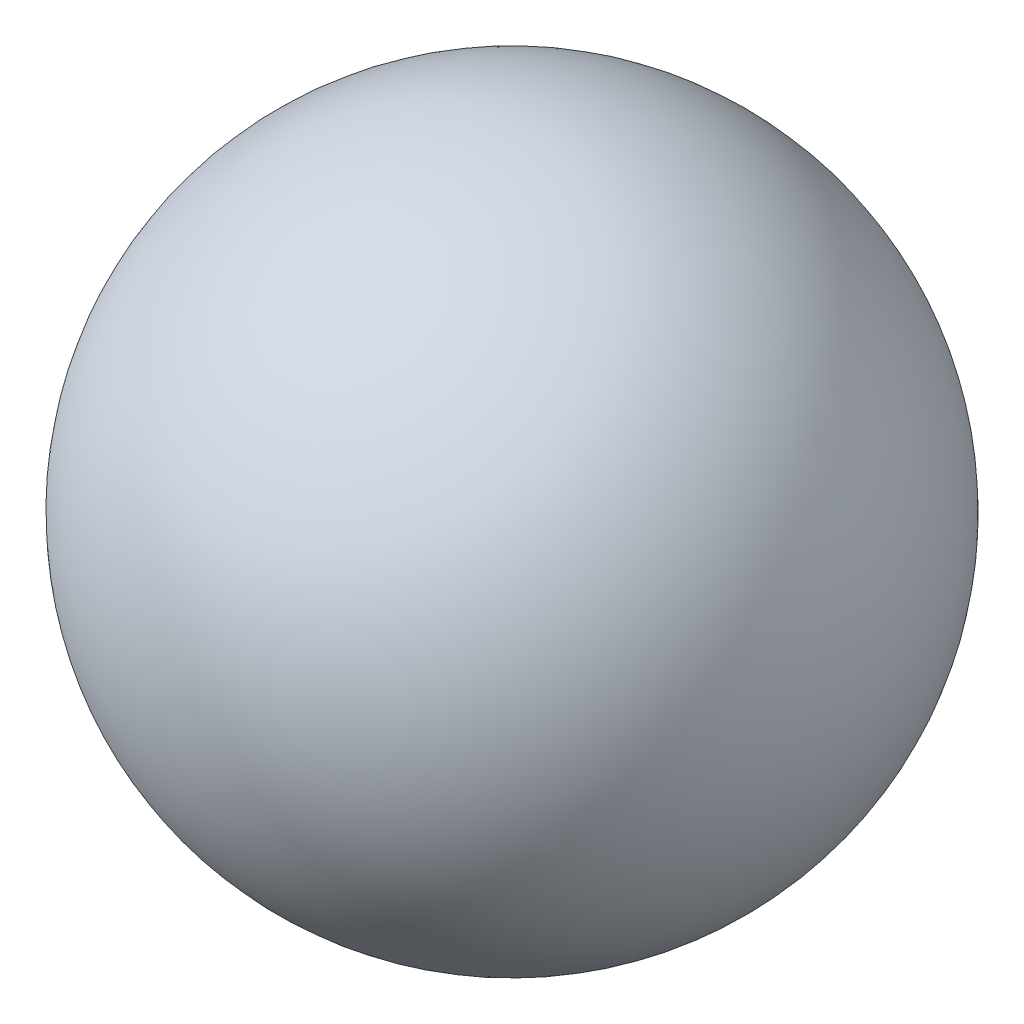
ISO-10303-21;
HEADER;
FILE_DESCRIPTION(('STEP AP214'),'2;1');
FILE_NAME('part.step','',(''),(''),'','','');
FILE_SCHEMA(('AUTOMOTIVE_DESIGN { 1 0 10303 214 1 1 1 1 }'));
ENDSEC;
DATA;
#1=APPLICATION_CONTEXT('core data for automotive mechanical design processes');
#2=APPLICATION_PROTOCOL_DEFINITION('international standard','automotive_design',2000,#1);
#3=PRODUCT_CONTEXT('',#1,'mechanical');
#4=PRODUCT('Part','Part','',(#3));
#5=PRODUCT_RELATED_PRODUCT_CATEGORY('part','',(#4));
#6=PRODUCT_DEFINITION_FORMATION('','',#4);
#7=PRODUCT_DEFINITION_CONTEXT('part definition',#1,'design');
#8=PRODUCT_DEFINITION('design','',#6,#7);
#9=PRODUCT_DEFINITION_SHAPE('','',#8);
#10=(LENGTH_UNIT() NAMED_UNIT(*) SI_UNIT(.MILLI.,.METRE.));
#11=(NAMED_UNIT(*) PLANE_ANGLE_UNIT() SI_UNIT($,.RADIAN.));
#12=(NAMED_UNIT(*) SI_UNIT($,.STERADIAN.) SOLID_ANGLE_UNIT());
#13=UNCERTAINTY_MEASURE_WITH_UNIT(LENGTH_MEASURE(1.E-05),#10,'distance_accuracy_value','');
#14=(GEOMETRIC_REPRESENTATION_CONTEXT(3) GLOBAL_UNCERTAINTY_ASSIGNED_CONTEXT((#13)) GLOBAL_UNIT_ASSIGNED_CONTEXT((#10,
#11,#12)) REPRESENTATION_CONTEXT('',''));
#15=CARTESIAN_POINT('',(0.,0.,0.));
#16=DIRECTION('',(0.,0.,1.));
#17=DIRECTION('',(1.,0.,0.));
#18=AXIS2_PLACEMENT_3D('',#15,#16,#17);
#19=CARTESIAN_POINT('',(-3.85672565811919,4.59626665871327,2.));
#20=DIRECTION('',(0.766044443118986,0.64278760968653,0.));
#21=DIRECTION('',(0.,0.,-1.));
#22=AXIS2_PLACEMENT_3D('',#19,#20,#21);
#23=SPHERICAL_SURFACE('',#22,1.04);
#24=CARTESIAN_POINT('',(-4.65341187896293,3.92776754463928,2.));
#25=VERTEX_POINT('',#24);
#26=VERTEX_LOOP('',#25);
#27=FACE_BOUND('',#26,.T.);
#28=ADVANCED_FACE('F15',(#27),#23,.T.);
#29=CLOSED_SHELL('',(#28));
#30=MANIFOLD_SOLID_BREP('B1',#29);
#31=ADVANCED_BREP_SHAPE_REPRESENTATION('',(#18,#30),#14);
#32=SHAPE_DEFINITION_REPRESENTATION(#9,#31);
ENDSEC;
END-ISO-10303-21;
